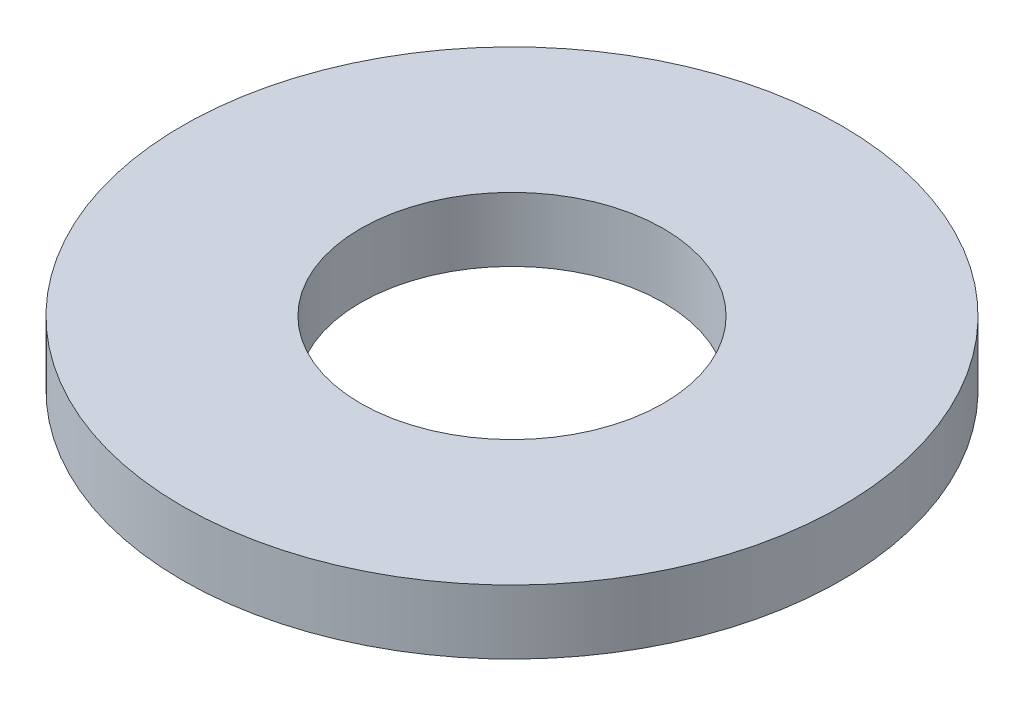
ISO-10303-21;
HEADER;
FILE_DESCRIPTION(('STEP AP214'),'2;1');
FILE_NAME('part.step','',(''),(''),'','','');
FILE_SCHEMA(('AUTOMOTIVE_DESIGN { 1 0 10303 214 1 1 1 1 }'));
ENDSEC;
DATA;
#1=APPLICATION_CONTEXT('core data for automotive mechanical design processes');
#2=APPLICATION_PROTOCOL_DEFINITION('international standard','automotive_design',2000,#1);
#3=PRODUCT_CONTEXT('',#1,'mechanical');
#4=PRODUCT('Part','Part','',(#3));
#5=PRODUCT_RELATED_PRODUCT_CATEGORY('part','',(#4));
#6=PRODUCT_DEFINITION_FORMATION('','',#4);
#7=PRODUCT_DEFINITION_CONTEXT('part definition',#1,'design');
#8=PRODUCT_DEFINITION('design','',#6,#7);
#9=PRODUCT_DEFINITION_SHAPE('','',#8);
#10=(LENGTH_UNIT() NAMED_UNIT(*) SI_UNIT(.MILLI.,.METRE.));
#11=(NAMED_UNIT(*) PLANE_ANGLE_UNIT() SI_UNIT($,.RADIAN.));
#12=(NAMED_UNIT(*) SI_UNIT($,.STERADIAN.) SOLID_ANGLE_UNIT());
#13=UNCERTAINTY_MEASURE_WITH_UNIT(LENGTH_MEASURE(1.E-05),#10,'distance_accuracy_value','');
#14=(GEOMETRIC_REPRESENTATION_CONTEXT(3) GLOBAL_UNCERTAINTY_ASSIGNED_CONTEXT((#13)) GLOBAL_UNIT_ASSIGNED_CONTEXT((#10,
#11,#12)) REPRESENTATION_CONTEXT('',''));
#15=CARTESIAN_POINT('',(0.,0.,0.));
#16=DIRECTION('',(0.,0.,1.));
#17=DIRECTION('',(1.,0.,0.));
#18=AXIS2_PLACEMENT_3D('',#15,#16,#17);
#19=CARTESIAN_POINT('',(0.,18.,0.));
#20=DIRECTION('',(0.,-1.,0.));
#21=DIRECTION('',(0.,0.,-1.));
#22=AXIS2_PLACEMENT_3D('',#19,#20,#21);
#23=CYLINDRICAL_SURFACE('',#22,92.5);
#24=CARTESIAN_POINT('',(0.,18.,0.));
#25=DIRECTION('',(0.,1.,0.));
#26=DIRECTION('',(0.,0.,1.));
#27=AXIS2_PLACEMENT_3D('',#24,#25,#26);
#28=CIRCLE('',#27,92.5);
#29=CARTESIAN_POINT('',(0.,18.,92.5));
#30=VERTEX_POINT('',#29);
#31=EDGE_CURVE('E10',#30,#30,#28,.T.);
#32=ORIENTED_EDGE('',*,*,#31,.F.);
#33=EDGE_LOOP('',(#32));
#34=FACE_BOUND('',#33,.T.);
#35=CARTESIAN_POINT('',(0.,0.,0.));
#36=DIRECTION('',(0.,1.,0.));
#37=DIRECTION('',(0.,0.,1.));
#38=AXIS2_PLACEMENT_3D('',#35,#36,#37);
#39=CIRCLE('',#38,92.5);
#40=CARTESIAN_POINT('',(0.,0.,92.5));
#41=VERTEX_POINT('',#40);
#42=EDGE_CURVE('E37',#41,#41,#39,.T.);
#43=ORIENTED_EDGE('',*,*,#42,.T.);
#44=EDGE_LOOP('',(#43));
#45=FACE_BOUND('',#44,.T.);
#46=ADVANCED_FACE('F40',(#34,#45),#23,.T.);
#47=CARTESIAN_POINT('',(0.,18.,0.));
#48=DIRECTION('',(0.,1.,0.));
#49=DIRECTION('',(0.,0.,1.));
#50=AXIS2_PLACEMENT_3D('',#47,#48,#49);
#51=PLANE('',#50);
#52=CARTESIAN_POINT('',(0.,18.,0.));
#53=DIRECTION('',(0.,1.,0.));
#54=DIRECTION('',(0.,0.,1.));
#55=AXIS2_PLACEMENT_3D('',#52,#53,#54);
#56=CIRCLE('',#55,42.5);
#57=CARTESIAN_POINT('',(0.,18.,42.5));
#58=VERTEX_POINT('',#57);
#59=EDGE_CURVE('E50',#58,#58,#56,.T.);
#60=ORIENTED_EDGE('',*,*,#59,.F.);
#61=EDGE_LOOP('',(#60));
#62=FACE_BOUND('',#61,.T.);
#63=ORIENTED_EDGE('',*,*,#31,.T.);
#64=EDGE_LOOP('',(#63));
#65=FACE_BOUND('',#64,.T.);
#66=ADVANCED_FACE('F59',(#62,#65),#51,.T.);
#67=CARTESIAN_POINT('',(0.,0.,0.));
#68=DIRECTION('',(0.,1.,0.));
#69=DIRECTION('',(0.,0.,1.));
#70=AXIS2_PLACEMENT_3D('',#67,#68,#69);
#71=PLANE('',#70);
#72=CARTESIAN_POINT('',(0.,0.,0.));
#73=DIRECTION('',(0.,1.,0.));
#74=DIRECTION('',(0.,0.,1.));
#75=AXIS2_PLACEMENT_3D('',#72,#73,#74);
#76=CIRCLE('',#75,42.5);
#77=CARTESIAN_POINT('',(0.,0.,42.5));
#78=VERTEX_POINT('',#77);
#79=EDGE_CURVE('E47',#78,#78,#76,.T.);
#80=ORIENTED_EDGE('',*,*,#79,.T.);
#81=EDGE_LOOP('',(#80));
#82=FACE_BOUND('',#81,.T.);
#83=ORIENTED_EDGE('',*,*,#42,.F.);
#84=EDGE_LOOP('',(#83));
#85=FACE_BOUND('',#84,.T.);
#86=ADVANCED_FACE('F58',(#82,#85),#71,.F.);
#87=CARTESIAN_POINT('',(0.,18.,0.));
#88=DIRECTION('',(0.,-1.,0.));
#89=DIRECTION('',(0.,0.,-1.));
#90=AXIS2_PLACEMENT_3D('',#87,#88,#89);
#91=CYLINDRICAL_SURFACE('',#90,42.5);
#92=ORIENTED_EDGE('',*,*,#59,.T.);
#93=EDGE_LOOP('',(#92));
#94=FACE_BOUND('',#93,.T.);
#95=ORIENTED_EDGE('',*,*,#79,.F.);
#96=EDGE_LOOP('',(#95));
#97=FACE_BOUND('',#96,.T.);
#98=ADVANCED_FACE('F54',(#94,#97),#91,.F.);
#99=CLOSED_SHELL('',(#46,#66,#86,#98));
#100=MANIFOLD_SOLID_BREP('B2',#99);
#101=ADVANCED_BREP_SHAPE_REPRESENTATION('',(#18,#100),#14);
#102=SHAPE_DEFINITION_REPRESENTATION(#9,#101);
ENDSEC;
END-ISO-10303-21;
